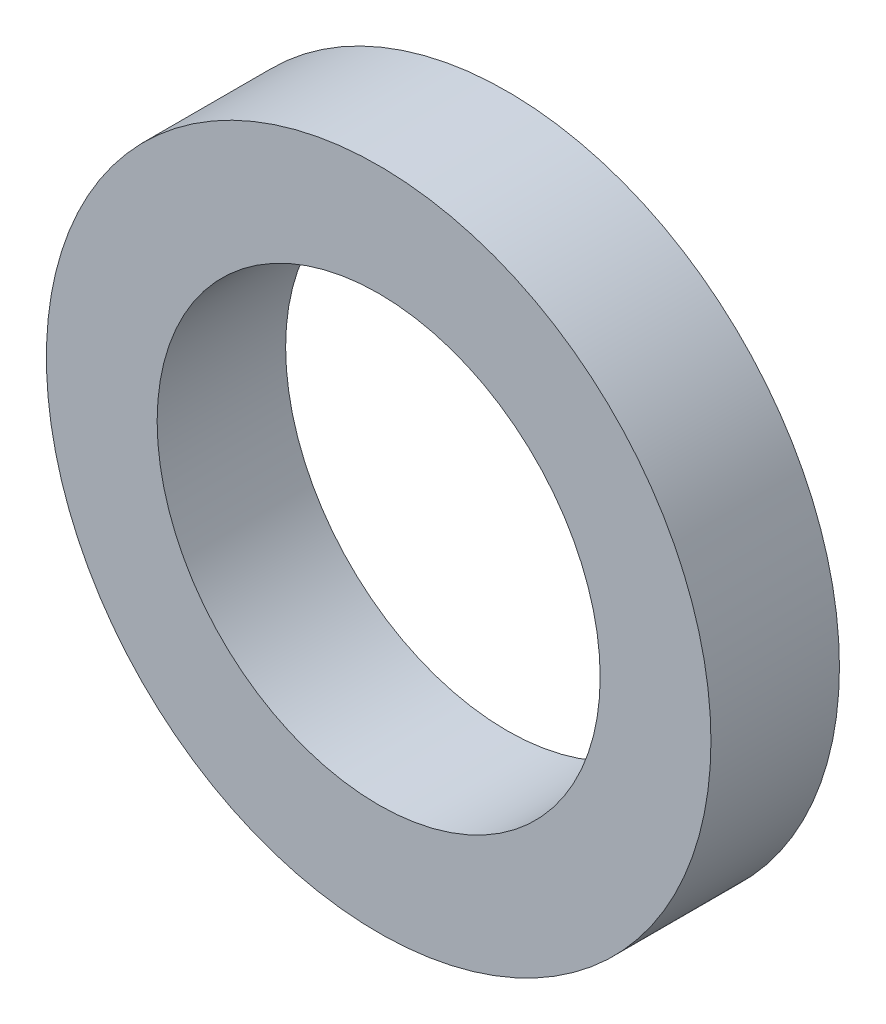
ISO-10303-21;
HEADER;
FILE_DESCRIPTION(('STEP AP214'),'2;1');
FILE_NAME('part.step','',(''),(''),'','','');
FILE_SCHEMA(('AUTOMOTIVE_DESIGN { 1 0 10303 214 1 1 1 1 }'));
ENDSEC;
DATA;
#1=APPLICATION_CONTEXT('core data for automotive mechanical design processes');
#2=APPLICATION_PROTOCOL_DEFINITION('international standard','automotive_design',2000,#1);
#3=PRODUCT_CONTEXT('',#1,'mechanical');
#4=PRODUCT('Part','Part','',(#3));
#5=PRODUCT_RELATED_PRODUCT_CATEGORY('part','',(#4));
#6=PRODUCT_DEFINITION_FORMATION('','',#4);
#7=PRODUCT_DEFINITION_CONTEXT('part definition',#1,'design');
#8=PRODUCT_DEFINITION('design','',#6,#7);
#9=PRODUCT_DEFINITION_SHAPE('','',#8);
#10=(LENGTH_UNIT() NAMED_UNIT(*) SI_UNIT(.MILLI.,.METRE.));
#11=(NAMED_UNIT(*) PLANE_ANGLE_UNIT() SI_UNIT($,.RADIAN.));
#12=(NAMED_UNIT(*) SI_UNIT($,.STERADIAN.) SOLID_ANGLE_UNIT());
#13=UNCERTAINTY_MEASURE_WITH_UNIT(LENGTH_MEASURE(1.E-05),#10,'distance_accuracy_value','');
#14=(GEOMETRIC_REPRESENTATION_CONTEXT(3) GLOBAL_UNCERTAINTY_ASSIGNED_CONTEXT((#13)) GLOBAL_UNIT_ASSIGNED_CONTEXT((#10,
#11,#12)) REPRESENTATION_CONTEXT('',''));
#15=CARTESIAN_POINT('',(0.,0.,0.));
#16=DIRECTION('',(0.,0.,1.));
#17=DIRECTION('',(1.,0.,0.));
#18=AXIS2_PLACEMENT_3D('',#15,#16,#17);
#19=CARTESIAN_POINT('',(0.,0.,3.683));
#20=DIRECTION('',(0.,0.,1.));
#21=DIRECTION('',(1.,0.,0.));
#22=AXIS2_PLACEMENT_3D('',#19,#20,#21);
#23=PLANE('',#22);
#24=CARTESIAN_POINT('',(0.,0.,3.683));
#25=DIRECTION('',(0.,0.,1.));
#26=DIRECTION('',(1.,0.,0.));
#27=AXIS2_PLACEMENT_3D('',#24,#25,#26);
#28=CIRCLE('',#27,9.525);
#29=CARTESIAN_POINT('',(9.525,0.,3.683));
#30=VERTEX_POINT('',#29);
#31=EDGE_CURVE('E10',#30,#30,#28,.T.);
#32=ORIENTED_EDGE('',*,*,#31,.T.);
#33=EDGE_LOOP('',(#32));
#34=FACE_BOUND('',#33,.T.);
#35=CARTESIAN_POINT('',(0.,0.,3.683));
#36=DIRECTION('',(0.,0.,1.));
#37=DIRECTION('',(1.,0.,0.));
#38=AXIS2_PLACEMENT_3D('',#35,#36,#37);
#39=CIRCLE('',#38,6.35);
#40=CARTESIAN_POINT('',(6.35,0.,3.683));
#41=VERTEX_POINT('',#40);
#42=EDGE_CURVE('E41',#41,#41,#39,.T.);
#43=ORIENTED_EDGE('',*,*,#42,.F.);
#44=EDGE_LOOP('',(#43));
#45=FACE_BOUND('',#44,.T.);
#46=ADVANCED_FACE('F30',(#34,#45),#23,.T.);
#47=CARTESIAN_POINT('',(0.,0.,0.));
#48=DIRECTION('',(0.,0.,1.));
#49=DIRECTION('',(1.,0.,0.));
#50=AXIS2_PLACEMENT_3D('',#47,#48,#49);
#51=PLANE('',#50);
#52=CARTESIAN_POINT('',(0.,0.,0.));
#53=DIRECTION('',(0.,0.,1.));
#54=DIRECTION('',(1.,0.,0.));
#55=AXIS2_PLACEMENT_3D('',#52,#53,#54);
#56=CIRCLE('',#55,9.525);
#57=CARTESIAN_POINT('',(9.525,0.,0.));
#58=VERTEX_POINT('',#57);
#59=EDGE_CURVE('E34',#58,#58,#56,.T.);
#60=ORIENTED_EDGE('',*,*,#59,.F.);
#61=EDGE_LOOP('',(#60));
#62=FACE_BOUND('',#61,.T.);
#63=CARTESIAN_POINT('',(0.,0.,0.));
#64=DIRECTION('',(0.,0.,1.));
#65=DIRECTION('',(1.,0.,0.));
#66=AXIS2_PLACEMENT_3D('',#63,#64,#65);
#67=CIRCLE('',#66,6.35);
#68=CARTESIAN_POINT('',(6.35,0.,0.));
#69=VERTEX_POINT('',#68);
#70=EDGE_CURVE('E43',#69,#69,#67,.T.);
#71=ORIENTED_EDGE('',*,*,#70,.T.);
#72=EDGE_LOOP('',(#71));
#73=FACE_BOUND('',#72,.T.);
#74=ADVANCED_FACE('F53',(#62,#73),#51,.F.);
#75=CARTESIAN_POINT('',(0.,0.,3.683));
#76=DIRECTION('',(0.,0.,-1.));
#77=DIRECTION('',(-1.,0.,0.));
#78=AXIS2_PLACEMENT_3D('',#75,#76,#77);
#79=CYLINDRICAL_SURFACE('',#78,9.525);
#80=ORIENTED_EDGE('',*,*,#31,.F.);
#81=EDGE_LOOP('',(#80));
#82=FACE_BOUND('',#81,.T.);
#83=ORIENTED_EDGE('',*,*,#59,.T.);
#84=EDGE_LOOP('',(#83));
#85=FACE_BOUND('',#84,.T.);
#86=ADVANCED_FACE('F32',(#82,#85),#79,.T.);
#87=CARTESIAN_POINT('',(0.,0.,3.683));
#88=DIRECTION('',(0.,0.,-1.));
#89=DIRECTION('',(-1.,0.,0.));
#90=AXIS2_PLACEMENT_3D('',#87,#88,#89);
#91=CYLINDRICAL_SURFACE('',#90,6.35);
#92=ORIENTED_EDGE('',*,*,#42,.T.);
#93=EDGE_LOOP('',(#92));
#94=FACE_BOUND('',#93,.T.);
#95=ORIENTED_EDGE('',*,*,#70,.F.);
#96=EDGE_LOOP('',(#95));
#97=FACE_BOUND('',#96,.T.);
#98=ADVANCED_FACE('F49',(#94,#97),#91,.F.);
#99=CLOSED_SHELL('',(#46,#74,#86,#98));
#100=MANIFOLD_SOLID_BREP('B2',#99);
#101=ADVANCED_BREP_SHAPE_REPRESENTATION('',(#18,#100),#14);
#102=SHAPE_DEFINITION_REPRESENTATION(#9,#101);
ENDSEC;
END-ISO-10303-21;
